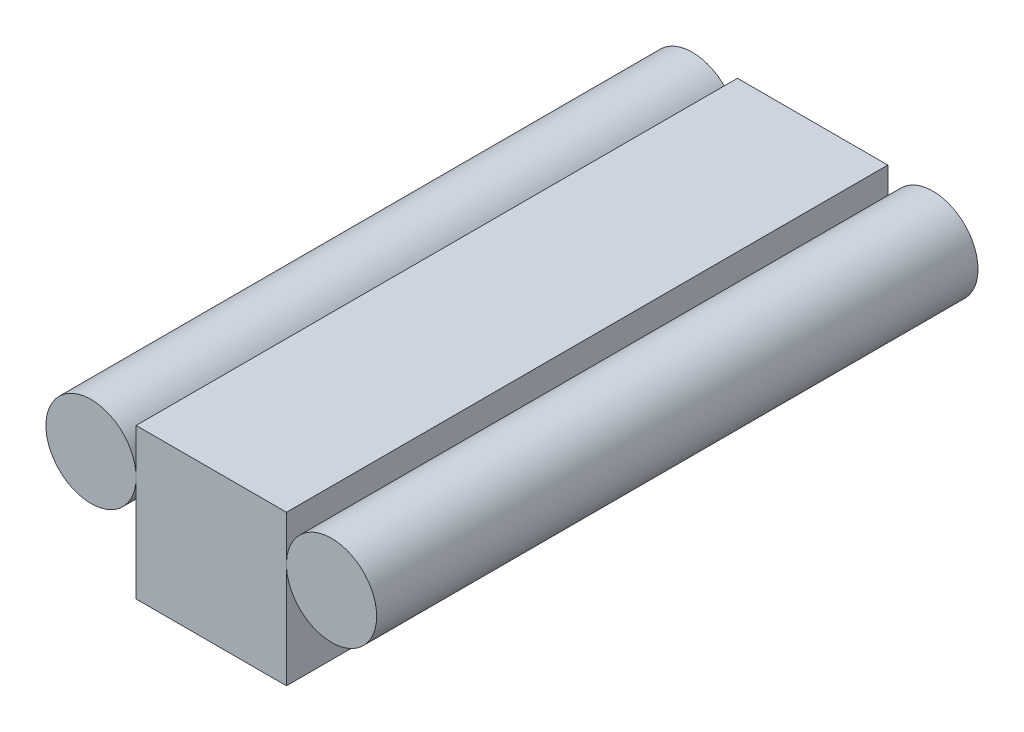
ISO-10303-21;
HEADER;
FILE_DESCRIPTION(('STEP AP214'),'2;1');
FILE_NAME('part.step','',(''),(''),'','','');
FILE_SCHEMA(('AUTOMOTIVE_DESIGN { 1 0 10303 214 1 1 1 1 }'));
ENDSEC;
DATA;
#1=APPLICATION_CONTEXT('core data for automotive mechanical design processes');
#2=APPLICATION_PROTOCOL_DEFINITION('international standard','automotive_design',2000,#1);
#3=PRODUCT_CONTEXT('',#1,'mechanical');
#4=PRODUCT('Part','Part','',(#3));
#5=PRODUCT_RELATED_PRODUCT_CATEGORY('part','',(#4));
#6=PRODUCT_DEFINITION_FORMATION('','',#4);
#7=PRODUCT_DEFINITION_CONTEXT('part definition',#1,'design');
#8=PRODUCT_DEFINITION('design','',#6,#7);
#9=PRODUCT_DEFINITION_SHAPE('','',#8);
#10=(LENGTH_UNIT() NAMED_UNIT(*) SI_UNIT(.MILLI.,.METRE.));
#11=(NAMED_UNIT(*) PLANE_ANGLE_UNIT() SI_UNIT($,.RADIAN.));
#12=(NAMED_UNIT(*) SI_UNIT($,.STERADIAN.) SOLID_ANGLE_UNIT());
#13=UNCERTAINTY_MEASURE_WITH_UNIT(LENGTH_MEASURE(1.E-05),#10,'distance_accuracy_value','');
#14=(GEOMETRIC_REPRESENTATION_CONTEXT(3) GLOBAL_UNCERTAINTY_ASSIGNED_CONTEXT((#13)) GLOBAL_UNIT_ASSIGNED_CONTEXT((#10,
#11,#12)) REPRESENTATION_CONTEXT('',''));
#15=CARTESIAN_POINT('',(0.,0.,0.));
#16=DIRECTION('',(0.,0.,1.));
#17=DIRECTION('',(1.,0.,0.));
#18=AXIS2_PLACEMENT_3D('',#15,#16,#17);
#19=CARTESIAN_POINT('',(0.,101.568732689772,2000.));
#20=DIRECTION('',(0.,-1.,0.));
#21=DIRECTION('',(1.,0.,0.));
#22=AXIS2_PLACEMENT_3D('',#19,#20,#21);
#23=PLANE('',#22);
#24=DIRECTION('',(-1.,0.,0.));
#25=VECTOR('',#24,1.);
#26=CARTESIAN_POINT('',(0.,101.568732689772,0.));
#27=LINE('',#26,#25);
#28=CARTESIAN_POINT('',(-1.1102229959837E-13,101.568732689772,0.));
#29=VERTEX_POINT('',#28);
#30=CARTESIAN_POINT('',(-500.,101.568732689771,0.));
#31=VERTEX_POINT('',#30);
#32=EDGE_CURVE('E121',#29,#31,#27,.T.);
#33=ORIENTED_EDGE('',*,*,#32,.T.);
#34=DIRECTION('',(0.,0.,-1.));
#35=VECTOR('',#34,1.);
#36=CARTESIAN_POINT('',(-500.,101.568732689771,2000.));
#37=LINE('',#36,#35);
#38=CARTESIAN_POINT('',(-500.,101.568732689771,2000.));
#39=VERTEX_POINT('',#38);
#40=EDGE_CURVE('E13',#39,#31,#37,.T.);
#41=ORIENTED_EDGE('',*,*,#40,.F.);
#42=DIRECTION('',(-1.,0.,0.));
#43=VECTOR('',#42,1.);
#44=CARTESIAN_POINT('',(0.,101.568732689772,2000.));
#45=LINE('',#44,#43);
#46=CARTESIAN_POINT('',(-1.1102229959837E-13,101.568732689772,2000.));
#47=VERTEX_POINT('',#46);
#48=EDGE_CURVE('E107',#47,#39,#45,.T.);
#49=ORIENTED_EDGE('',*,*,#48,.F.);
#50=DIRECTION('',(0.,0.,-1.));
#51=VECTOR('',#50,1.);
#52=CARTESIAN_POINT('',(-1.1102229959837E-13,101.568732689772,2000.));
#53=LINE('',#52,#51);
#54=EDGE_CURVE('E74',#47,#29,#53,.T.);
#55=ORIENTED_EDGE('',*,*,#54,.T.);
#56=EDGE_LOOP('',(#33,#41,#49,#55));
#57=FACE_BOUND('',#56,.T.);
#58=ADVANCED_FACE('F58',(#57),#23,.F.);
#59=CARTESIAN_POINT('',(-500.,-1.11022302462516E-13,2000.));
#60=DIRECTION('',(1.,0.,0.));
#61=DIRECTION('',(0.,1.,0.));
#62=AXIS2_PLACEMENT_3D('',#59,#60,#61);
#63=PLANE('',#62);
#64=DIRECTION('',(0.,-1.,0.));
#65=VECTOR('',#64,1.);
#66=CARTESIAN_POINT('',(-500.,-1.11022302462516E-13,0.));
#67=LINE('',#66,#65);
#68=CARTESIAN_POINT('',(-500.,-398.431267310228,0.));
#69=VERTEX_POINT('',#68);
#70=EDGE_CURVE('E112',#31,#69,#67,.T.);
#71=ORIENTED_EDGE('',*,*,#70,.T.);
#72=DIRECTION('',(0.,0.,-1.));
#73=VECTOR('',#72,1.);
#74=CARTESIAN_POINT('',(-500.,-398.431267310228,2000.));
#75=LINE('',#74,#73);
#76=CARTESIAN_POINT('',(-500.,-398.431267310228,2000.));
#77=VERTEX_POINT('',#76);
#78=EDGE_CURVE('E66',#77,#69,#75,.T.);
#79=ORIENTED_EDGE('',*,*,#78,.F.);
#80=DIRECTION('',(0.,-1.,0.));
#81=VECTOR('',#80,1.);
#82=CARTESIAN_POINT('',(-500.,-1.11022302462516E-13,2000.));
#83=LINE('',#82,#81);
#84=EDGE_CURVE('E99',#39,#77,#83,.T.);
#85=ORIENTED_EDGE('',*,*,#84,.F.);
#86=ORIENTED_EDGE('',*,*,#40,.T.);
#87=EDGE_LOOP('',(#71,#79,#85,#86));
#88=FACE_BOUND('',#87,.T.);
#89=ADVANCED_FACE('F111',(#88),#63,.F.);
#90=CARTESIAN_POINT('',(0.,-398.431267310228,2000.));
#91=DIRECTION('',(0.,-1.,0.));
#92=DIRECTION('',(0.,0.,-1.));
#93=AXIS2_PLACEMENT_3D('',#90,#91,#92);
#94=PLANE('',#93);
#95=DIRECTION('',(-1.,0.,0.));
#96=VECTOR('',#95,1.);
#97=CARTESIAN_POINT('',(0.,-398.431267310228,0.));
#98=LINE('',#97,#96);
#99=CARTESIAN_POINT('',(0.,-398.431267310228,0.));
#100=VERTEX_POINT('',#99);
#101=EDGE_CURVE('E124',#100,#69,#98,.T.);
#102=ORIENTED_EDGE('',*,*,#101,.F.);
#103=DIRECTION('',(0.,0.,-1.));
#104=VECTOR('',#103,1.);
#105=CARTESIAN_POINT('',(0.,-398.431267310228,2000.));
#106=LINE('',#105,#104);
#107=CARTESIAN_POINT('',(0.,-398.431267310228,2000.));
#108=VERTEX_POINT('',#107);
#109=EDGE_CURVE('E88',#108,#100,#106,.T.);
#110=ORIENTED_EDGE('',*,*,#109,.F.);
#111=DIRECTION('',(-1.,0.,0.));
#112=VECTOR('',#111,1.);
#113=CARTESIAN_POINT('',(0.,-398.431267310228,2000.));
#114=LINE('',#113,#112);
#115=EDGE_CURVE('E106',#108,#77,#114,.T.);
#116=ORIENTED_EDGE('',*,*,#115,.T.);
#117=ORIENTED_EDGE('',*,*,#78,.T.);
#118=EDGE_LOOP('',(#102,#110,#116,#117));
#119=FACE_BOUND('',#118,.T.);
#120=ADVANCED_FACE('F115',(#119),#94,.T.);
#121=CARTESIAN_POINT('',(-1.00071320687408E-13,0.,2000.));
#122=DIRECTION('',(1.,0.,0.));
#123=DIRECTION('',(0.,1.,0.));
#124=AXIS2_PLACEMENT_3D('',#121,#122,#123);
#125=PLANE('',#124);
#126=DIRECTION('',(0.,-1.,0.));
#127=VECTOR('',#126,1.);
#128=CARTESIAN_POINT('',(-1.00071320687408E-13,0.,0.));
#129=LINE('',#128,#127);
#130=EDGE_CURVE('E126',#29,#100,#129,.T.);
#131=ORIENTED_EDGE('',*,*,#130,.F.);
#132=ORIENTED_EDGE('',*,*,#54,.F.);
#133=DIRECTION('',(0.,-1.,0.));
#134=VECTOR('',#133,1.);
#135=CARTESIAN_POINT('',(-1.00071320687408E-13,0.,2000.));
#136=LINE('',#135,#134);
#137=EDGE_CURVE('E116',#47,#108,#136,.T.);
#138=ORIENTED_EDGE('',*,*,#137,.T.);
#139=ORIENTED_EDGE('',*,*,#109,.T.);
#140=EDGE_LOOP('',(#131,#132,#138,#139));
#141=FACE_BOUND('',#140,.T.);
#142=ADVANCED_FACE('F132',(#141),#125,.T.);
#143=CARTESIAN_POINT('',(0.,0.,2000.));
#144=DIRECTION('',(0.,0.,1.));
#145=DIRECTION('',(1.,0.,0.));
#146=AXIS2_PLACEMENT_3D('',#143,#144,#145);
#147=PLANE('',#146);
#148=ORIENTED_EDGE('',*,*,#48,.T.);
#149=ORIENTED_EDGE('',*,*,#84,.T.);
#150=ORIENTED_EDGE('',*,*,#115,.F.);
#151=ORIENTED_EDGE('',*,*,#137,.F.);
#152=EDGE_LOOP('',(#148,#149,#150,#151));
#153=FACE_BOUND('',#152,.T.);
#154=ADVANCED_FACE('F103',(#153),#147,.T.);
#155=CARTESIAN_POINT('',(0.,0.,0.));
#156=DIRECTION('',(0.,0.,1.));
#157=DIRECTION('',(1.,0.,0.));
#158=AXIS2_PLACEMENT_3D('',#155,#156,#157);
#159=PLANE('',#158);
#160=ORIENTED_EDGE('',*,*,#32,.F.);
#161=ORIENTED_EDGE('',*,*,#130,.T.);
#162=ORIENTED_EDGE('',*,*,#101,.T.);
#163=ORIENTED_EDGE('',*,*,#70,.F.);
#164=EDGE_LOOP('',(#160,#161,#162,#163));
#165=FACE_BOUND('',#164,.T.);
#166=ADVANCED_FACE('F131',(#165),#159,.F.);
#167=CLOSED_SHELL('',(#58,#89,#120,#142,#154,#166));
#168=MANIFOLD_SOLID_BREP('B2',#167);
#169=CARTESIAN_POINT('',(150.,-48.4312673102285,2000.));
#170=DIRECTION('',(0.,0.,-1.));
#171=DIRECTION('',(-1.,0.,0.));
#172=AXIS2_PLACEMENT_3D('',#169,#170,#171);
#173=CYLINDRICAL_SURFACE('',#172,150.);
#174=CARTESIAN_POINT('',(150.,-48.4312673102285,2000.));
#175=DIRECTION('',(0.,0.,1.));
#176=DIRECTION('',(1.,0.,0.));
#177=AXIS2_PLACEMENT_3D('',#174,#175,#176);
#178=CIRCLE('',#177,150.);
#179=CARTESIAN_POINT('',(300.,-48.4312673102285,2000.));
#180=VERTEX_POINT('',#179);
#181=EDGE_CURVE('E57',#180,#180,#178,.T.);
#182=ORIENTED_EDGE('',*,*,#181,.F.);
#183=EDGE_LOOP('',(#182));
#184=FACE_BOUND('',#183,.T.);
#185=CARTESIAN_POINT('',(150.,-48.4312673102285,0.));
#186=DIRECTION('',(0.,0.,1.));
#187=DIRECTION('',(1.,0.,0.));
#188=AXIS2_PLACEMENT_3D('',#185,#186,#187);
#189=CIRCLE('',#188,150.);
#190=CARTESIAN_POINT('',(300.,-48.4312673102285,0.));
#191=VERTEX_POINT('',#190);
#192=EDGE_CURVE('E191',#191,#191,#189,.T.);
#193=ORIENTED_EDGE('',*,*,#192,.T.);
#194=EDGE_LOOP('',(#193));
#195=FACE_BOUND('',#194,.T.);
#196=ADVANCED_FACE('F188',(#184,#195),#173,.T.);
#197=CARTESIAN_POINT('',(0.,0.,2000.));
#198=DIRECTION('',(0.,0.,1.));
#199=DIRECTION('',(1.,0.,0.));
#200=AXIS2_PLACEMENT_3D('',#197,#198,#199);
#201=PLANE('',#200);
#202=ORIENTED_EDGE('',*,*,#181,.T.);
#203=EDGE_LOOP('',(#202));
#204=FACE_BOUND('',#203,.T.);
#205=ADVANCED_FACE('F203',(#204),#201,.T.);
#206=CARTESIAN_POINT('',(0.,0.,0.));
#207=DIRECTION('',(0.,0.,1.));
#208=DIRECTION('',(1.,0.,0.));
#209=AXIS2_PLACEMENT_3D('',#206,#207,#208);
#210=PLANE('',#209);
#211=ORIENTED_EDGE('',*,*,#192,.F.);
#212=EDGE_LOOP('',(#211));
#213=FACE_BOUND('',#212,.T.);
#214=ADVANCED_FACE('F201',(#213),#210,.F.);
#215=CLOSED_SHELL('',(#196,#205,#214));
#216=MANIFOLD_SOLID_BREP('B7',#215);
#217=CARTESIAN_POINT('',(-650.,-48.4312673102285,2000.));
#218=DIRECTION('',(0.,0.,-1.));
#219=DIRECTION('',(-1.,0.,0.));
#220=AXIS2_PLACEMENT_3D('',#217,#218,#219);
#221=CYLINDRICAL_SURFACE('',#220,150.);
#222=CARTESIAN_POINT('',(-650.,-48.4312673102285,2000.));
#223=DIRECTION('',(0.,0.,1.));
#224=DIRECTION('',(1.,0.,0.));
#225=AXIS2_PLACEMENT_3D('',#222,#223,#224);
#226=CIRCLE('',#225,150.);
#227=CARTESIAN_POINT('',(-500.,-48.4312673102285,2000.));
#228=VERTEX_POINT('',#227);
#229=EDGE_CURVE('E187',#228,#228,#226,.T.);
#230=ORIENTED_EDGE('',*,*,#229,.F.);
#231=EDGE_LOOP('',(#230));
#232=FACE_BOUND('',#231,.T.);
#233=CARTESIAN_POINT('',(-650.,-48.4312673102285,0.));
#234=DIRECTION('',(0.,0.,1.));
#235=DIRECTION('',(1.,0.,0.));
#236=AXIS2_PLACEMENT_3D('',#233,#234,#235);
#237=CIRCLE('',#236,150.);
#238=CARTESIAN_POINT('',(-500.,-48.4312673102285,0.));
#239=VERTEX_POINT('',#238);
#240=EDGE_CURVE('E231',#239,#239,#237,.T.);
#241=ORIENTED_EDGE('',*,*,#240,.T.);
#242=EDGE_LOOP('',(#241));
#243=FACE_BOUND('',#242,.T.);
#244=ADVANCED_FACE('F228',(#232,#243),#221,.T.);
#245=CARTESIAN_POINT('',(0.,0.,2000.));
#246=DIRECTION('',(0.,0.,1.));
#247=DIRECTION('',(1.,0.,0.));
#248=AXIS2_PLACEMENT_3D('',#245,#246,#247);
#249=PLANE('',#248);
#250=ORIENTED_EDGE('',*,*,#229,.T.);
#251=EDGE_LOOP('',(#250));
#252=FACE_BOUND('',#251,.T.);
#253=ADVANCED_FACE('F243',(#252),#249,.T.);
#254=CARTESIAN_POINT('',(0.,0.,0.));
#255=DIRECTION('',(0.,0.,1.));
#256=DIRECTION('',(1.,0.,0.));
#257=AXIS2_PLACEMENT_3D('',#254,#255,#256);
#258=PLANE('',#257);
#259=ORIENTED_EDGE('',*,*,#240,.F.);
#260=EDGE_LOOP('',(#259));
#261=FACE_BOUND('',#260,.T.);
#262=ADVANCED_FACE('F241',(#261),#258,.F.);
#263=CLOSED_SHELL('',(#244,#253,#262));
#264=MANIFOLD_SOLID_BREP('B52',#263);
#265=ADVANCED_BREP_SHAPE_REPRESENTATION('',(#18,#168,#216,#264),#14);
#266=SHAPE_DEFINITION_REPRESENTATION(#9,#265);
ENDSEC;
END-ISO-10303-21;
